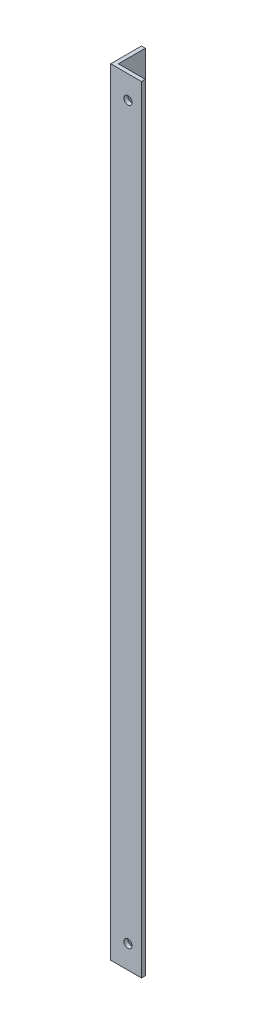
ISO-10303-21;
HEADER;
FILE_DESCRIPTION(('STEP AP214'),'2;1');
FILE_NAME('part.step','',(''),(''),'','','');
FILE_SCHEMA(('AUTOMOTIVE_DESIGN { 1 0 10303 214 1 1 1 1 }'));
ENDSEC;
DATA;
#1=APPLICATION_CONTEXT('core data for automotive mechanical design processes');
#2=APPLICATION_PROTOCOL_DEFINITION('international standard','automotive_design',2000,#1);
#3=PRODUCT_CONTEXT('',#1,'mechanical');
#4=PRODUCT('Part','Part','',(#3));
#5=PRODUCT_RELATED_PRODUCT_CATEGORY('part','',(#4));
#6=PRODUCT_DEFINITION_FORMATION('','',#4);
#7=PRODUCT_DEFINITION_CONTEXT('part definition',#1,'design');
#8=PRODUCT_DEFINITION('design','',#6,#7);
#9=PRODUCT_DEFINITION_SHAPE('','',#8);
#10=(LENGTH_UNIT() NAMED_UNIT(*) SI_UNIT(.MILLI.,.METRE.));
#11=(NAMED_UNIT(*) PLANE_ANGLE_UNIT() SI_UNIT($,.RADIAN.));
#12=(NAMED_UNIT(*) SI_UNIT($,.STERADIAN.) SOLID_ANGLE_UNIT());
#13=UNCERTAINTY_MEASURE_WITH_UNIT(LENGTH_MEASURE(1.E-05),#10,'distance_accuracy_value','');
#14=(GEOMETRIC_REPRESENTATION_CONTEXT(3) GLOBAL_UNCERTAINTY_ASSIGNED_CONTEXT((#13)) GLOBAL_UNIT_ASSIGNED_CONTEXT((#10,
#11,#12)) REPRESENTATION_CONTEXT('',''));
#15=CARTESIAN_POINT('',(0.,0.,0.));
#16=DIRECTION('',(0.,0.,1.));
#17=DIRECTION('',(1.,0.,0.));
#18=AXIS2_PLACEMENT_3D('',#15,#16,#17);
#19=CARTESIAN_POINT('',(-2.70893847012686E-13,4697.98318780426,-1.2490009027033E-13));
#20=DIRECTION('',(0.,-1.,0.));
#21=DIRECTION('',(0.964326147917118,0.,0.26471698178117));
#22=AXIS2_PLACEMENT_3D('',#19,#20,#21);
#23=PLANE('',#22);
#24=DIRECTION('',(0.,0.,1.));
#25=VECTOR('',#24,1.);
#26=CARTESIAN_POINT('',(-3.212623577969E-13,4697.98318780426,-9.26415744040256));
#27=LINE('',#26,#25);
#28=CARTESIAN_POINT('',(-4.2332746829372E-13,4697.98318780426,-25.4000000000004));
#29=VERTEX_POINT('',#28);
#30=CARTESIAN_POINT('',(-1.76969493025665E-12,4697.98318780426,-3.46944695195361E-13));
#31=VERTEX_POINT('',#30);
#32=EDGE_CURVE('E127',#29,#31,#27,.T.);
#33=ORIENTED_EDGE('',*,*,#32,.F.);
#34=DIRECTION('',(-1.,0.,0.));
#35=VECTOR('',#34,1.);
#36=CARTESIAN_POINT('',(3.47928548599299,4697.98318780426,-25.4000000000007));
#37=LINE('',#36,#35);
#38=CARTESIAN_POINT('',(3.17500000000023,4697.98318780426,-25.4000000000002));
#39=VERTEX_POINT('',#38);
#40=EDGE_CURVE('E117',#39,#29,#37,.T.);
#41=ORIENTED_EDGE('',*,*,#40,.F.);
#42=DIRECTION('',(0.,0.,-1.));
#43=VECTOR('',#42,1.);
#44=CARTESIAN_POINT('',(3.17499999999988,4697.98318780426,-7.24450947344692));
#45=LINE('',#44,#43);
#46=CARTESIAN_POINT('',(3.17499999999971,4697.98318780426,-3.17500000000027));
#47=VERTEX_POINT('',#46);
#48=EDGE_CURVE('E126',#47,#39,#45,.T.);
#49=ORIENTED_EDGE('',*,*,#48,.F.);
#50=DIRECTION('',(-1.,0.,0.));
#51=VECTOR('',#50,1.);
#52=CARTESIAN_POINT('',(37.7288822935268,4697.98318780426,-3.17500000000027));
#53=LINE('',#52,#51);
#54=CARTESIAN_POINT('',(25.3999999999998,4697.98318780426,-3.17500000000027));
#55=VERTEX_POINT('',#54);
#56=EDGE_CURVE('E188',#55,#47,#53,.T.);
#57=ORIENTED_EDGE('',*,*,#56,.F.);
#58=DIRECTION('',(0.,0.,-1.));
#59=VECTOR('',#58,1.);
#60=CARTESIAN_POINT('',(25.3999999999995,4697.98318780426,1.99446789168177));
#61=LINE('',#60,#59);
#62=CARTESIAN_POINT('',(25.3999999999985,4697.98318780426,-3.46944695195361E-13));
#63=VERTEX_POINT('',#62);
#64=EDGE_CURVE('E185',#63,#55,#61,.T.);
#65=ORIENTED_EDGE('',*,*,#64,.F.);
#66=DIRECTION('',(1.,0.,0.));
#67=VECTOR('',#66,1.);
#68=CARTESIAN_POINT('',(1023.22734869566,4697.98318780426,5.41233724504764E-13));
#69=LINE('',#68,#67);
#70=EDGE_CURVE('E131',#31,#63,#69,.T.);
#71=ORIENTED_EDGE('',*,*,#70,.F.);
#72=EDGE_LOOP('',(#33,#41,#49,#57,#65,#71));
#73=FACE_BOUND('',#72,.T.);
#74=ADVANCED_FACE('F44',(#73),#23,.T.);
#75=CARTESIAN_POINT('',(3.47928548599341,323.969932125539,-25.4000000000006));
#76=DIRECTION('',(0.,0.,-1.));
#77=DIRECTION('',(-1.,0.,0.));
#78=AXIS2_PLACEMENT_3D('',#75,#76,#77);
#79=PLANE('',#78);
#80=DIRECTION('',(0.,1.,0.));
#81=VECTOR('',#80,1.);
#82=CARTESIAN_POINT('',(3.17500000000059,323.969932125538,-25.4000000000001));
#83=LINE('',#82,#81);
#84=CARTESIAN_POINT('',(3.17500000000035,5339.2174578054,-25.4000000000002));
#85=VERTEX_POINT('',#84);
#86=EDGE_CURVE('E66',#39,#85,#83,.T.);
#87=ORIENTED_EDGE('',*,*,#86,.F.);
#88=ORIENTED_EDGE('',*,*,#40,.T.);
#89=DIRECTION('',(0.,1.,0.));
#90=VECTOR('',#89,1.);
#91=CARTESIAN_POINT('',(0.,323.969932125539,-25.4000000000006));
#92=LINE('',#91,#90);
#93=CARTESIAN_POINT('',(-3.02220964878658E-13,5339.2174578054,-25.4000000000002));
#94=VERTEX_POINT('',#93);
#95=EDGE_CURVE('E121',#29,#94,#92,.T.);
#96=ORIENTED_EDGE('',*,*,#95,.T.);
#97=DIRECTION('',(1.,0.,0.));
#98=VECTOR('',#97,1.);
#99=CARTESIAN_POINT('',(3.47928548599416,5339.2174578054,-25.4000000000002));
#100=LINE('',#99,#98);
#101=EDGE_CURVE('E11',#94,#85,#100,.T.);
#102=ORIENTED_EDGE('',*,*,#101,.T.);
#103=EDGE_LOOP('',(#87,#88,#96,#102));
#104=FACE_BOUND('',#103,.T.);
#105=ADVANCED_FACE('F119',(#104),#79,.T.);
#106=CARTESIAN_POINT('',(3.17500000000025,323.969932125538,-7.24450947344737));
#107=DIRECTION('',(1.,0.,0.));
#108=DIRECTION('',(0.,0.,-1.));
#109=AXIS2_PLACEMENT_3D('',#106,#107,#108);
#110=PLANE('',#109);
#111=DIRECTION('',(0.,1.,0.));
#112=VECTOR('',#111,1.);
#113=CARTESIAN_POINT('',(3.17500000000014,323.969932125539,-3.17500000000079));
#114=LINE('',#113,#112);
#115=CARTESIAN_POINT('',(3.17499999999984,5339.2174578054,-3.1750000000005));
#116=VERTEX_POINT('',#115);
#117=EDGE_CURVE('E77',#47,#116,#114,.T.);
#118=ORIENTED_EDGE('',*,*,#117,.F.);
#119=ORIENTED_EDGE('',*,*,#48,.T.);
#120=ORIENTED_EDGE('',*,*,#86,.T.);
#121=DIRECTION('',(0.,0.,1.));
#122=VECTOR('',#121,1.);
#123=CARTESIAN_POINT('',(3.17499999999995,5339.2174578054,-7.2445094734467));
#124=LINE('',#123,#122);
#125=EDGE_CURVE('E54',#85,#116,#124,.T.);
#126=ORIENTED_EDGE('',*,*,#125,.T.);
#127=EDGE_LOOP('',(#118,#119,#120,#126));
#128=FACE_BOUND('',#127,.T.);
#129=ADVANCED_FACE('F227',(#128),#110,.T.);
#130=CARTESIAN_POINT('',(37.7288822935272,323.969932125538,-3.1750000000003));
#131=DIRECTION('',(0.,0.,-1.));
#132=DIRECTION('',(-1.,0.,0.));
#133=AXIS2_PLACEMENT_3D('',#130,#131,#132);
#134=PLANE('',#133);
#135=CARTESIAN_POINT('',(14.2875,5320.1674578054,-3.17500000000094));
#136=DIRECTION('',(0.,0.,-1.));
#137=DIRECTION('',(-1.,0.,0.));
#138=AXIS2_PLACEMENT_3D('',#135,#136,#137);
#139=CIRCLE('',#138,3.37820000000005);
#140=CARTESIAN_POINT('',(10.9092999999999,5320.1674578054,-3.17500000000094));
#141=VERTEX_POINT('',#140);
#142=EDGE_CURVE('E154',#141,#141,#139,.F.);
#143=ORIENTED_EDGE('',*,*,#142,.T.);
#144=EDGE_LOOP('',(#143));
#145=FACE_BOUND('',#144,.T.);
#146=CARTESIAN_POINT('',(14.2874999999999,4717.03318780426,-3.17500000000094));
#147=DIRECTION('',(0.,0.,-1.));
#148=DIRECTION('',(-1.,0.,0.));
#149=AXIS2_PLACEMENT_3D('',#146,#147,#148);
#150=CIRCLE('',#149,3.37820000000005);
#151=CARTESIAN_POINT('',(10.9092999999999,4717.03318780426,-3.17500000000094));
#152=VERTEX_POINT('',#151);
#153=EDGE_CURVE('E135',#152,#152,#150,.F.);
#154=ORIENTED_EDGE('',*,*,#153,.T.);
#155=EDGE_LOOP('',(#154));
#156=FACE_BOUND('',#155,.T.);
#157=DIRECTION('',(0.,1.,0.));
#158=VECTOR('',#157,1.);
#159=CARTESIAN_POINT('',(25.3999999999997,323.969932125538,-3.17500000000054));
#160=LINE('',#159,#158);
#161=CARTESIAN_POINT('',(25.3999999999994,5339.2174578054,-3.1750000000005));
#162=VERTEX_POINT('',#161);
#163=EDGE_CURVE('E198',#55,#162,#160,.T.);
#164=ORIENTED_EDGE('',*,*,#163,.F.);
#165=ORIENTED_EDGE('',*,*,#56,.T.);
#166=ORIENTED_EDGE('',*,*,#117,.T.);
#167=DIRECTION('',(1.,0.,0.));
#168=VECTOR('',#167,1.);
#169=CARTESIAN_POINT('',(37.728882293528,5339.2174578054,-3.1750000000005));
#170=LINE('',#169,#168);
#171=EDGE_CURVE('E174',#116,#162,#170,.T.);
#172=ORIENTED_EDGE('',*,*,#171,.T.);
#173=EDGE_LOOP('',(#164,#165,#166,#172));
#174=FACE_BOUND('',#173,.T.);
#175=ADVANCED_FACE('F225',(#145,#156,#174),#134,.T.);
#176=CARTESIAN_POINT('',(166.234228507342,5339.21745780539,12.7019999999999));
#177=DIRECTION('',(0.,1.,0.));
#178=DIRECTION('',(0.26471698178117,0.,-0.964326147917118));
#179=AXIS2_PLACEMENT_3D('',#176,#177,#178);
#180=PLANE('',#179);
#181=ORIENTED_EDGE('',*,*,#101,.F.);
#182=DIRECTION('',(0.,0.,-1.));
#183=VECTOR('',#182,1.);
#184=CARTESIAN_POINT('',(-2.55667005613097E-13,5339.2174578054,-9.26415744040256));
#185=LINE('',#184,#183);
#186=CARTESIAN_POINT('',(-1.64858842684159E-12,5339.2174578054,-3.46944695195361E-13));
#187=VERTEX_POINT('',#186);
#188=EDGE_CURVE('E139',#187,#94,#185,.T.);
#189=ORIENTED_EDGE('',*,*,#188,.F.);
#190=DIRECTION('',(-1.,0.,0.));
#191=VECTOR('',#190,1.);
#192=CARTESIAN_POINT('',(1023.22734869566,5339.2174578054,0.));
#193=LINE('',#192,#191);
#194=CARTESIAN_POINT('',(25.3999999999986,5339.2174578054,-1.2490009027033E-13));
#195=VERTEX_POINT('',#194);
#196=EDGE_CURVE('E142',#195,#187,#193,.T.);
#197=ORIENTED_EDGE('',*,*,#196,.F.);
#198=DIRECTION('',(0.,0.,1.));
#199=VECTOR('',#198,1.);
#200=CARTESIAN_POINT('',(25.3999999999995,5339.2174578054,1.99446789168221));
#201=LINE('',#200,#199);
#202=EDGE_CURVE('E177',#162,#195,#201,.T.);
#203=ORIENTED_EDGE('',*,*,#202,.F.);
#204=ORIENTED_EDGE('',*,*,#171,.F.);
#205=ORIENTED_EDGE('',*,*,#125,.F.);
#206=EDGE_LOOP('',(#181,#189,#197,#203,#204,#205));
#207=FACE_BOUND('',#206,.T.);
#208=ADVANCED_FACE('F224',(#207),#180,.T.);
#209=CARTESIAN_POINT('',(25.3999999999998,323.969932125538,1.99446789168183));
#210=DIRECTION('',(1.,0.,0.));
#211=DIRECTION('',(0.,0.,-1.));
#212=AXIS2_PLACEMENT_3D('',#209,#210,#211);
#213=PLANE('',#212);
#214=DIRECTION('',(0.,1.,0.));
#215=VECTOR('',#214,1.);
#216=CARTESIAN_POINT('',(25.3999999999989,323.969932125538,-3.33066907387547E-13));
#217=LINE('',#216,#215);
#218=EDGE_CURVE('E195',#63,#195,#217,.T.);
#219=ORIENTED_EDGE('',*,*,#218,.F.);
#220=ORIENTED_EDGE('',*,*,#64,.T.);
#221=ORIENTED_EDGE('',*,*,#163,.T.);
#222=ORIENTED_EDGE('',*,*,#202,.T.);
#223=EDGE_LOOP('',(#219,#220,#221,#222));
#224=FACE_BOUND('',#223,.T.);
#225=ADVANCED_FACE('F220',(#224),#213,.T.);
#226=CARTESIAN_POINT('',(0.,323.969932125539,-9.26415744040308));
#227=DIRECTION('',(-1.,0.,0.));
#228=DIRECTION('',(0.,0.,1.));
#229=AXIS2_PLACEMENT_3D('',#226,#227,#228);
#230=PLANE('',#229);
#231=ORIENTED_EDGE('',*,*,#95,.F.);
#232=ORIENTED_EDGE('',*,*,#32,.T.);
#233=DIRECTION('',(0.,1.,0.));
#234=VECTOR('',#233,1.);
#235=CARTESIAN_POINT('',(-1.34880446887026E-12,323.969932125538,-3.46944695195361E-13));
#236=LINE('',#235,#234);
#237=EDGE_CURVE('E184',#31,#187,#236,.T.);
#238=ORIENTED_EDGE('',*,*,#237,.T.);
#239=ORIENTED_EDGE('',*,*,#188,.T.);
#240=EDGE_LOOP('',(#231,#232,#238,#239));
#241=FACE_BOUND('',#240,.T.);
#242=ADVANCED_FACE('F137',(#241),#230,.T.);
#243=CARTESIAN_POINT('',(1023.22734869566,323.969932125538,0.));
#244=DIRECTION('',(0.,0.,1.));
#245=DIRECTION('',(1.,0.,0.));
#246=AXIS2_PLACEMENT_3D('',#243,#244,#245);
#247=PLANE('',#246);
#248=CARTESIAN_POINT('',(14.2874999999996,5320.1674578054,-5.68989300120393E-13));
#249=DIRECTION('',(0.,0.,1.));
#250=DIRECTION('',(1.,0.,0.));
#251=AXIS2_PLACEMENT_3D('',#248,#249,#250);
#252=CIRCLE('',#251,3.37820000000005);
#253=CARTESIAN_POINT('',(17.6656999999996,5320.1674578054,-5.68860349508766E-13));
#254=VERTEX_POINT('',#253);
#255=EDGE_CURVE('E48',#254,#254,#252,.F.);
#256=ORIENTED_EDGE('',*,*,#255,.T.);
#257=EDGE_LOOP('',(#256));
#258=FACE_BOUND('',#257,.T.);
#259=CARTESIAN_POINT('',(14.2874999999995,4717.03318780426,-5.68989300120393E-13));
#260=DIRECTION('',(0.,0.,1.));
#261=DIRECTION('',(1.,0.,0.));
#262=AXIS2_PLACEMENT_3D('',#259,#260,#261);
#263=CIRCLE('',#262,3.37820000000005);
#264=CARTESIAN_POINT('',(17.6656999999996,4717.03318780426,-5.68860349508766E-13));
#265=VERTEX_POINT('',#264);
#266=EDGE_CURVE('E151',#265,#265,#263,.F.);
#267=ORIENTED_EDGE('',*,*,#266,.T.);
#268=EDGE_LOOP('',(#267));
#269=FACE_BOUND('',#268,.T.);
#270=ORIENTED_EDGE('',*,*,#237,.F.);
#271=ORIENTED_EDGE('',*,*,#70,.T.);
#272=ORIENTED_EDGE('',*,*,#218,.T.);
#273=ORIENTED_EDGE('',*,*,#196,.T.);
#274=EDGE_LOOP('',(#270,#271,#272,#273));
#275=FACE_BOUND('',#274,.T.);
#276=ADVANCED_FACE('F46',(#258,#269,#275),#247,.T.);
#277=CARTESIAN_POINT('',(14.2875000000024,4717.03318780426,-3553.21699062703));
#278=DIRECTION('',(0.,0.,1.));
#279=DIRECTION('',(1.,0.,0.));
#280=AXIS2_PLACEMENT_3D('',#277,#278,#279);
#281=CYLINDRICAL_SURFACE('',#280,3.37820000000005);
#282=ORIENTED_EDGE('',*,*,#153,.F.);
#283=EDGE_LOOP('',(#282));
#284=FACE_BOUND('',#283,.T.);
#285=ORIENTED_EDGE('',*,*,#266,.F.);
#286=EDGE_LOOP('',(#285));
#287=FACE_BOUND('',#286,.T.);
#288=ADVANCED_FACE('F242',(#284,#287),#281,.F.);
#289=CARTESIAN_POINT('',(14.2875000000024,5320.1674578054,-3553.21699062703));
#290=DIRECTION('',(0.,0.,1.));
#291=DIRECTION('',(1.,0.,0.));
#292=AXIS2_PLACEMENT_3D('',#289,#290,#291);
#293=CYLINDRICAL_SURFACE('',#292,3.37820000000005);
#294=ORIENTED_EDGE('',*,*,#142,.F.);
#295=EDGE_LOOP('',(#294));
#296=FACE_BOUND('',#295,.T.);
#297=ORIENTED_EDGE('',*,*,#255,.F.);
#298=EDGE_LOOP('',(#297));
#299=FACE_BOUND('',#298,.T.);
#300=ADVANCED_FACE('F247',(#296,#299),#293,.F.);
#301=CLOSED_SHELL('',(#74,#105,#129,#175,#208,#225,#242,#276,#288,#300));
#302=MANIFOLD_SOLID_BREP('B2',#301);
#303=ADVANCED_BREP_SHAPE_REPRESENTATION('',(#18,#302),#14);
#304=SHAPE_DEFINITION_REPRESENTATION(#9,#303);
ENDSEC;
END-ISO-10303-21;
